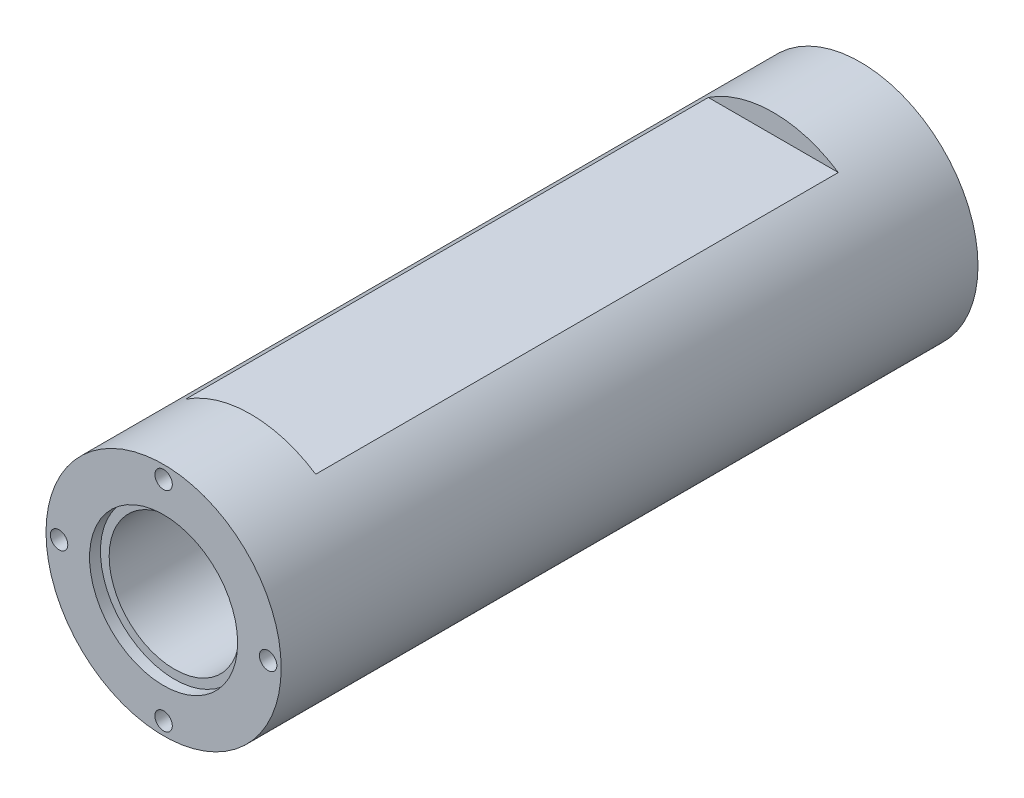
ISO-10303-21;
HEADER;
FILE_DESCRIPTION(('STEP AP214'),'2;1');
FILE_NAME('part.step','',(''),(''),'','','');
FILE_SCHEMA(('AUTOMOTIVE_DESIGN { 1 0 10303 214 1 1 1 1 }'));
ENDSEC;
DATA;
#1=APPLICATION_CONTEXT('core data for automotive mechanical design processes');
#2=APPLICATION_PROTOCOL_DEFINITION('international standard','automotive_design',2000,#1);
#3=PRODUCT_CONTEXT('',#1,'mechanical');
#4=PRODUCT('Part','Part','',(#3));
#5=PRODUCT_RELATED_PRODUCT_CATEGORY('part','',(#4));
#6=PRODUCT_DEFINITION_FORMATION('','',#4);
#7=PRODUCT_DEFINITION_CONTEXT('part definition',#1,'design');
#8=PRODUCT_DEFINITION('design','',#6,#7);
#9=PRODUCT_DEFINITION_SHAPE('','',#8);
#10=(LENGTH_UNIT() NAMED_UNIT(*) SI_UNIT(.MILLI.,.METRE.));
#11=(NAMED_UNIT(*) PLANE_ANGLE_UNIT() SI_UNIT($,.RADIAN.));
#12=(NAMED_UNIT(*) SI_UNIT($,.STERADIAN.) SOLID_ANGLE_UNIT());
#13=UNCERTAINTY_MEASURE_WITH_UNIT(LENGTH_MEASURE(1.E-05),#10,'distance_accuracy_value','');
#14=(GEOMETRIC_REPRESENTATION_CONTEXT(3) GLOBAL_UNCERTAINTY_ASSIGNED_CONTEXT((#13)) GLOBAL_UNIT_ASSIGNED_CONTEXT((#10,
#11,#12)) REPRESENTATION_CONTEXT('',''));
#15=CARTESIAN_POINT('',(0.,0.,0.));
#16=DIRECTION('',(0.,0.,1.));
#17=DIRECTION('',(1.,0.,0.));
#18=AXIS2_PLACEMENT_3D('',#15,#16,#17);
#19=CARTESIAN_POINT('',(0.,0.,160.));
#20=DIRECTION('',(0.,0.,-1.));
#21=DIRECTION('',(-1.,0.,0.));
#22=AXIS2_PLACEMENT_3D('',#19,#20,#21);
#23=CYLINDRICAL_SURFACE('',#22,15.);
#24=CARTESIAN_POINT('',(0.,0.,157.5));
#25=DIRECTION('',(0.,0.,1.));
#26=DIRECTION('',(1.,0.,0.));
#27=AXIS2_PLACEMENT_3D('',#24,#25,#26);
#28=CIRCLE('',#27,15.);
#29=CARTESIAN_POINT('',(15.,0.,157.5));
#30=VERTEX_POINT('',#29);
#31=EDGE_CURVE('E156',#30,#30,#28,.T.);
#32=ORIENTED_EDGE('',*,*,#31,.T.);
#33=EDGE_LOOP('',(#32));
#34=FACE_BOUND('',#33,.T.);
#35=CARTESIAN_POINT('',(0.,0.,2.5));
#36=DIRECTION('',(0.,0.,-1.));
#37=DIRECTION('',(-1.,0.,0.));
#38=AXIS2_PLACEMENT_3D('',#35,#36,#37);
#39=CIRCLE('',#38,15.);
#40=CARTESIAN_POINT('',(-15.,0.,2.5));
#41=VERTEX_POINT('',#40);
#42=EDGE_CURVE('E165',#41,#41,#39,.T.);
#43=ORIENTED_EDGE('',*,*,#42,.T.);
#44=EDGE_LOOP('',(#43));
#45=FACE_BOUND('',#44,.T.);
#46=ADVANCED_FACE('F31',(#34,#45),#23,.F.);
#47=CARTESIAN_POINT('',(0.,0.,160.));
#48=DIRECTION('',(0.,0.,1.));
#49=DIRECTION('',(1.,0.,0.));
#50=AXIS2_PLACEMENT_3D('',#47,#48,#49);
#51=PLANE('',#50);
#52=CARTESIAN_POINT('',(0.,0.,160.));
#53=DIRECTION('',(0.,0.,1.));
#54=DIRECTION('',(1.,0.,0.));
#55=AXIS2_PLACEMENT_3D('',#52,#53,#54);
#56=CIRCLE('',#55,17.);
#57=CARTESIAN_POINT('',(17.,0.,160.));
#58=VERTEX_POINT('',#57);
#59=EDGE_CURVE('E153',#58,#58,#56,.T.);
#60=ORIENTED_EDGE('',*,*,#59,.F.);
#61=EDGE_LOOP('',(#60));
#62=FACE_BOUND('',#61,.T.);
#63=CARTESIAN_POINT('',(-23.9999999999997,-3.35182354132111E-13,160.));
#64=DIRECTION('',(0.,0.,1.));
#65=DIRECTION('',(1.,0.,0.));
#66=AXIS2_PLACEMENT_3D('',#63,#64,#65);
#67=CIRCLE('',#66,2.00000000000066);
#68=CARTESIAN_POINT('',(-21.999999999999,-3.35182354132111E-13,160.));
#69=VERTEX_POINT('',#68);
#70=EDGE_CURVE('E123',#69,#69,#67,.T.);
#71=ORIENTED_EDGE('',*,*,#70,.F.);
#72=EDGE_LOOP('',(#71));
#73=FACE_BOUND('',#72,.T.);
#74=CARTESIAN_POINT('',(6.76243012900129E-13,-24.,160.));
#75=DIRECTION('',(0.,0.,1.));
#76=DIRECTION('',(1.,0.,0.));
#77=AXIS2_PLACEMENT_3D('',#74,#75,#76);
#78=CIRCLE('',#77,2.00000000000081);
#79=CARTESIAN_POINT('',(2.00000000000148,-24.,160.));
#80=VERTEX_POINT('',#79);
#81=EDGE_CURVE('E117',#80,#80,#78,.T.);
#82=ORIENTED_EDGE('',*,*,#81,.F.);
#83=EDGE_LOOP('',(#82));
#84=FACE_BOUND('',#83,.T.);
#85=CARTESIAN_POINT('',(24.,0.,160.));
#86=DIRECTION('',(0.,0.,1.));
#87=DIRECTION('',(1.,0.,0.));
#88=AXIS2_PLACEMENT_3D('',#85,#86,#87);
#89=CIRCLE('',#88,2.);
#90=CARTESIAN_POINT('',(26.,0.,160.));
#91=VERTEX_POINT('',#90);
#92=EDGE_CURVE('E111',#91,#91,#89,.T.);
#93=ORIENTED_EDGE('',*,*,#92,.F.);
#94=EDGE_LOOP('',(#93));
#95=FACE_BOUND('',#94,.T.);
#96=CARTESIAN_POINT('',(0.,24.,160.));
#97=DIRECTION('',(0.,0.,1.));
#98=DIRECTION('',(1.,0.,0.));
#99=AXIS2_PLACEMENT_3D('',#96,#97,#98);
#100=CIRCLE('',#99,2.);
#101=CARTESIAN_POINT('',(2.,24.,160.));
#102=VERTEX_POINT('',#101);
#103=EDGE_CURVE('E105',#102,#102,#100,.T.);
#104=ORIENTED_EDGE('',*,*,#103,.F.);
#105=EDGE_LOOP('',(#104));
#106=FACE_BOUND('',#105,.T.);
#107=CARTESIAN_POINT('',(0.,0.,160.));
#108=DIRECTION('',(0.,0.,1.));
#109=DIRECTION('',(1.,0.,0.));
#110=AXIS2_PLACEMENT_3D('',#107,#108,#109);
#111=CIRCLE('',#110,27.);
#112=CARTESIAN_POINT('',(27.,0.,160.));
#113=VERTEX_POINT('',#112);
#114=EDGE_CURVE('E98',#113,#113,#111,.T.);
#115=ORIENTED_EDGE('',*,*,#114,.T.);
#116=EDGE_LOOP('',(#115));
#117=FACE_BOUND('',#116,.T.);
#118=ADVANCED_FACE('F188',(#62,#73,#84,#95,#106,#117),#51,.T.);
#119=CARTESIAN_POINT('',(0.,0.,0.));
#120=DIRECTION('',(0.,0.,1.));
#121=DIRECTION('',(1.,0.,0.));
#122=AXIS2_PLACEMENT_3D('',#119,#120,#121);
#123=PLANE('',#122);
#124=CARTESIAN_POINT('',(0.,0.,0.));
#125=DIRECTION('',(0.,0.,-1.));
#126=DIRECTION('',(-1.,0.,0.));
#127=AXIS2_PLACEMENT_3D('',#124,#125,#126);
#128=CIRCLE('',#127,17.);
#129=CARTESIAN_POINT('',(-17.,0.,0.));
#130=VERTEX_POINT('',#129);
#131=EDGE_CURVE('E162',#130,#130,#128,.T.);
#132=ORIENTED_EDGE('',*,*,#131,.F.);
#133=EDGE_LOOP('',(#132));
#134=FACE_BOUND('',#133,.T.);
#135=CARTESIAN_POINT('',(23.9999999999997,-3.35182354132111E-13,0.));
#136=DIRECTION('',(0.,0.,-1.));
#137=DIRECTION('',(-1.,0.,0.));
#138=AXIS2_PLACEMENT_3D('',#135,#136,#137);
#139=CIRCLE('',#138,2.00000000000066);
#140=CARTESIAN_POINT('',(21.999999999999,-3.35182354132111E-13,0.));
#141=VERTEX_POINT('',#140);
#142=EDGE_CURVE('E147',#141,#141,#139,.T.);
#143=ORIENTED_EDGE('',*,*,#142,.F.);
#144=EDGE_LOOP('',(#143));
#145=FACE_BOUND('',#144,.T.);
#146=CARTESIAN_POINT('',(-6.76243012900129E-13,-24.,0.));
#147=DIRECTION('',(0.,0.,-1.));
#148=DIRECTION('',(-1.,0.,0.));
#149=AXIS2_PLACEMENT_3D('',#146,#147,#148);
#150=CIRCLE('',#149,2.00000000000081);
#151=CARTESIAN_POINT('',(-2.00000000000148,-24.,0.));
#152=VERTEX_POINT('',#151);
#153=EDGE_CURVE('E141',#152,#152,#150,.T.);
#154=ORIENTED_EDGE('',*,*,#153,.F.);
#155=EDGE_LOOP('',(#154));
#156=FACE_BOUND('',#155,.T.);
#157=CARTESIAN_POINT('',(-24.,0.,0.));
#158=DIRECTION('',(0.,0.,-1.));
#159=DIRECTION('',(-1.,0.,0.));
#160=AXIS2_PLACEMENT_3D('',#157,#158,#159);
#161=CIRCLE('',#160,2.);
#162=CARTESIAN_POINT('',(-26.,0.,0.));
#163=VERTEX_POINT('',#162);
#164=EDGE_CURVE('E135',#163,#163,#161,.T.);
#165=ORIENTED_EDGE('',*,*,#164,.F.);
#166=EDGE_LOOP('',(#165));
#167=FACE_BOUND('',#166,.T.);
#168=CARTESIAN_POINT('',(0.,24.,0.));
#169=DIRECTION('',(0.,0.,-1.));
#170=DIRECTION('',(-1.,0.,0.));
#171=AXIS2_PLACEMENT_3D('',#168,#169,#170);
#172=CIRCLE('',#171,2.);
#173=CARTESIAN_POINT('',(-2.,24.,0.));
#174=VERTEX_POINT('',#173);
#175=EDGE_CURVE('E129',#174,#174,#172,.T.);
#176=ORIENTED_EDGE('',*,*,#175,.F.);
#177=EDGE_LOOP('',(#176));
#178=FACE_BOUND('',#177,.T.);
#179=CARTESIAN_POINT('',(0.,0.,0.));
#180=DIRECTION('',(0.,0.,1.));
#181=DIRECTION('',(1.,0.,0.));
#182=AXIS2_PLACEMENT_3D('',#179,#180,#181);
#183=CIRCLE('',#182,27.);
#184=CARTESIAN_POINT('',(27.,0.,0.));
#185=VERTEX_POINT('',#184);
#186=EDGE_CURVE('E99',#185,#185,#183,.T.);
#187=ORIENTED_EDGE('',*,*,#186,.F.);
#188=EDGE_LOOP('',(#187));
#189=FACE_BOUND('',#188,.T.);
#190=ADVANCED_FACE('F194',(#134,#145,#156,#167,#178,#189),#123,.F.);
#191=CARTESIAN_POINT('',(0.,0.,160.));
#192=DIRECTION('',(0.,0.,-1.));
#193=DIRECTION('',(-1.,0.,0.));
#194=AXIS2_PLACEMENT_3D('',#191,#192,#193);
#195=CYLINDRICAL_SURFACE('',#194,27.);
#196=DIRECTION('',(0.,0.,-1.));
#197=VECTOR('',#196,1.);
#198=CARTESIAN_POINT('',(16.9705627484771,-21.,160.));
#199=LINE('',#198,#197);
#200=CARTESIAN_POINT('',(16.9705627484771,-21.,140.));
#201=VERTEX_POINT('',#200);
#202=CARTESIAN_POINT('',(16.9705627484771,-21.,20.));
#203=VERTEX_POINT('',#202);
#204=EDGE_CURVE('E11',#201,#203,#199,.T.);
#205=ORIENTED_EDGE('',*,*,#204,.T.);
#206=CARTESIAN_POINT('',(0.,0.,20.));
#207=DIRECTION('',(0.,0.,-1.));
#208=DIRECTION('',(0.,1.,0.));
#209=AXIS2_PLACEMENT_3D('',#206,#207,#208);
#210=CIRCLE('',#209,27.);
#211=CARTESIAN_POINT('',(-16.9705627484771,-21.,20.));
#212=VERTEX_POINT('',#211);
#213=EDGE_CURVE('E70',#203,#212,#210,.T.);
#214=ORIENTED_EDGE('',*,*,#213,.T.);
#215=DIRECTION('',(0.,0.,-1.));
#216=VECTOR('',#215,1.);
#217=CARTESIAN_POINT('',(-16.9705627484771,-21.,160.));
#218=LINE('',#217,#216);
#219=CARTESIAN_POINT('',(-16.9705627484771,-21.,140.));
#220=VERTEX_POINT('',#219);
#221=EDGE_CURVE('E74',#212,#220,#218,.F.);
#222=ORIENTED_EDGE('',*,*,#221,.T.);
#223=CARTESIAN_POINT('',(0.,0.,140.));
#224=DIRECTION('',(0.,0.,1.));
#225=DIRECTION('',(1.,0.,0.));
#226=AXIS2_PLACEMENT_3D('',#223,#224,#225);
#227=CIRCLE('',#226,27.);
#228=EDGE_CURVE('E39',#220,#201,#227,.T.);
#229=ORIENTED_EDGE('',*,*,#228,.T.);
#230=EDGE_LOOP('',(#205,#214,#222,#229));
#231=FACE_BOUND('',#230,.T.);
#232=DIRECTION('',(0.,0.,-1.));
#233=VECTOR('',#232,1.);
#234=CARTESIAN_POINT('',(14.9248115565993,22.5,160.));
#235=LINE('',#234,#233);
#236=CARTESIAN_POINT('',(14.9248115565993,22.5,20.));
#237=VERTEX_POINT('',#236);
#238=CARTESIAN_POINT('',(14.9248115565993,22.5,140.));
#239=VERTEX_POINT('',#238);
#240=EDGE_CURVE('E75',#237,#239,#235,.F.);
#241=ORIENTED_EDGE('',*,*,#240,.T.);
#242=CARTESIAN_POINT('',(0.,0.,140.));
#243=DIRECTION('',(0.,0.,1.));
#244=DIRECTION('',(1.,0.,0.));
#245=AXIS2_PLACEMENT_3D('',#242,#243,#244);
#246=CIRCLE('',#245,27.);
#247=CARTESIAN_POINT('',(-14.9248115565993,22.5,140.));
#248=VERTEX_POINT('',#247);
#249=EDGE_CURVE('E95',#239,#248,#246,.T.);
#250=ORIENTED_EDGE('',*,*,#249,.T.);
#251=DIRECTION('',(0.,0.,-1.));
#252=VECTOR('',#251,1.);
#253=CARTESIAN_POINT('',(-14.9248115565993,22.5,160.));
#254=LINE('',#253,#252);
#255=CARTESIAN_POINT('',(-14.9248115565993,22.5,20.));
#256=VERTEX_POINT('',#255);
#257=EDGE_CURVE('E92',#248,#256,#254,.T.);
#258=ORIENTED_EDGE('',*,*,#257,.T.);
#259=CARTESIAN_POINT('',(0.,0.,20.));
#260=DIRECTION('',(0.,0.,-1.));
#261=DIRECTION('',(0.,1.,0.));
#262=AXIS2_PLACEMENT_3D('',#259,#260,#261);
#263=CIRCLE('',#262,27.);
#264=EDGE_CURVE('E90',#256,#237,#263,.T.);
#265=ORIENTED_EDGE('',*,*,#264,.T.);
#266=EDGE_LOOP('',(#241,#250,#258,#265));
#267=FACE_BOUND('',#266,.T.);
#268=ORIENTED_EDGE('',*,*,#114,.F.);
#269=EDGE_LOOP('',(#268));
#270=FACE_BOUND('',#269,.T.);
#271=ORIENTED_EDGE('',*,*,#186,.T.);
#272=EDGE_LOOP('',(#271));
#273=FACE_BOUND('',#272,.T.);
#274=ADVANCED_FACE('F33',(#231,#267,#270,#273),#195,.T.);
#275=CARTESIAN_POINT('',(0.,24.,145.));
#276=DIRECTION('',(0.,0.,1.));
#277=DIRECTION('',(1.,0.,0.));
#278=AXIS2_PLACEMENT_3D('',#275,#276,#277);
#279=CYLINDRICAL_SURFACE('',#278,2.);
#280=CARTESIAN_POINT('',(0.,24.,145.));
#281=DIRECTION('',(0.,0.,1.));
#282=DIRECTION('',(1.,0.,0.));
#283=AXIS2_PLACEMENT_3D('',#280,#281,#282);
#284=CIRCLE('',#283,2.);
#285=CARTESIAN_POINT('',(2.,24.,145.));
#286=VERTEX_POINT('',#285);
#287=EDGE_CURVE('E102',#286,#286,#284,.T.);
#288=ORIENTED_EDGE('',*,*,#287,.F.);
#289=EDGE_LOOP('',(#288));
#290=FACE_BOUND('',#289,.T.);
#291=ORIENTED_EDGE('',*,*,#103,.T.);
#292=EDGE_LOOP('',(#291));
#293=FACE_BOUND('',#292,.T.);
#294=ADVANCED_FACE('F199',(#290,#293),#279,.F.);
#295=CARTESIAN_POINT('',(0.,24.,145.));
#296=DIRECTION('',(0.,0.,1.));
#297=DIRECTION('',(1.,0.,0.));
#298=AXIS2_PLACEMENT_3D('',#295,#296,#297);
#299=PLANE('',#298);
#300=ORIENTED_EDGE('',*,*,#287,.T.);
#301=EDGE_LOOP('',(#300));
#302=FACE_BOUND('',#301,.T.);
#303=ADVANCED_FACE('F255',(#302),#299,.T.);
#304=CARTESIAN_POINT('',(24.,0.,145.));
#305=DIRECTION('',(0.,0.,1.));
#306=DIRECTION('',(1.,0.,0.));
#307=AXIS2_PLACEMENT_3D('',#304,#305,#306);
#308=CYLINDRICAL_SURFACE('',#307,2.);
#309=CARTESIAN_POINT('',(24.,0.,145.));
#310=DIRECTION('',(0.,0.,1.));
#311=DIRECTION('',(1.,0.,0.));
#312=AXIS2_PLACEMENT_3D('',#309,#310,#311);
#313=CIRCLE('',#312,2.);
#314=CARTESIAN_POINT('',(26.,0.,145.));
#315=VERTEX_POINT('',#314);
#316=EDGE_CURVE('E108',#315,#315,#313,.T.);
#317=ORIENTED_EDGE('',*,*,#316,.F.);
#318=EDGE_LOOP('',(#317));
#319=FACE_BOUND('',#318,.T.);
#320=ORIENTED_EDGE('',*,*,#92,.T.);
#321=EDGE_LOOP('',(#320));
#322=FACE_BOUND('',#321,.T.);
#323=ADVANCED_FACE('F252',(#319,#322),#308,.F.);
#324=CARTESIAN_POINT('',(24.,0.,145.));
#325=DIRECTION('',(0.,0.,1.));
#326=DIRECTION('',(1.,0.,0.));
#327=AXIS2_PLACEMENT_3D('',#324,#325,#326);
#328=PLANE('',#327);
#329=ORIENTED_EDGE('',*,*,#316,.T.);
#330=EDGE_LOOP('',(#329));
#331=FACE_BOUND('',#330,.T.);
#332=ADVANCED_FACE('F248',(#331),#328,.T.);
#333=CARTESIAN_POINT('',(6.76243012900129E-13,-24.,145.));
#334=DIRECTION('',(0.,0.,1.));
#335=DIRECTION('',(1.,0.,0.));
#336=AXIS2_PLACEMENT_3D('',#333,#334,#335);
#337=CYLINDRICAL_SURFACE('',#336,2.00000000000081);
#338=CARTESIAN_POINT('',(6.76243012900129E-13,-24.,145.));
#339=DIRECTION('',(0.,0.,1.));
#340=DIRECTION('',(1.,0.,0.));
#341=AXIS2_PLACEMENT_3D('',#338,#339,#340);
#342=CIRCLE('',#341,2.00000000000081);
#343=CARTESIAN_POINT('',(2.00000000000148,-24.,145.));
#344=VERTEX_POINT('',#343);
#345=EDGE_CURVE('E114',#344,#344,#342,.T.);
#346=ORIENTED_EDGE('',*,*,#345,.F.);
#347=EDGE_LOOP('',(#346));
#348=FACE_BOUND('',#347,.T.);
#349=ORIENTED_EDGE('',*,*,#81,.T.);
#350=EDGE_LOOP('',(#349));
#351=FACE_BOUND('',#350,.T.);
#352=ADVANCED_FACE('F244',(#348,#351),#337,.F.);
#353=CARTESIAN_POINT('',(6.76243012900129E-13,-24.,145.));
#354=DIRECTION('',(0.,0.,1.));
#355=DIRECTION('',(1.,0.,0.));
#356=AXIS2_PLACEMENT_3D('',#353,#354,#355);
#357=PLANE('',#356);
#358=ORIENTED_EDGE('',*,*,#345,.T.);
#359=EDGE_LOOP('',(#358));
#360=FACE_BOUND('',#359,.T.);
#361=ADVANCED_FACE('F240',(#360),#357,.T.);
#362=CARTESIAN_POINT('',(-23.9999999999997,-3.35182354132111E-13,145.));
#363=DIRECTION('',(0.,0.,1.));
#364=DIRECTION('',(1.,0.,0.));
#365=AXIS2_PLACEMENT_3D('',#362,#363,#364);
#366=CYLINDRICAL_SURFACE('',#365,2.00000000000066);
#367=CARTESIAN_POINT('',(-23.9999999999997,-3.35182354132111E-13,145.));
#368=DIRECTION('',(0.,0.,1.));
#369=DIRECTION('',(1.,0.,0.));
#370=AXIS2_PLACEMENT_3D('',#367,#368,#369);
#371=CIRCLE('',#370,2.00000000000066);
#372=CARTESIAN_POINT('',(-21.999999999999,-3.35182354132111E-13,145.));
#373=VERTEX_POINT('',#372);
#374=EDGE_CURVE('E120',#373,#373,#371,.T.);
#375=ORIENTED_EDGE('',*,*,#374,.F.);
#376=EDGE_LOOP('',(#375));
#377=FACE_BOUND('',#376,.T.);
#378=ORIENTED_EDGE('',*,*,#70,.T.);
#379=EDGE_LOOP('',(#378));
#380=FACE_BOUND('',#379,.T.);
#381=ADVANCED_FACE('F232',(#377,#380),#366,.F.);
#382=CARTESIAN_POINT('',(-23.9999999999997,-3.35182354132111E-13,145.));
#383=DIRECTION('',(0.,0.,1.));
#384=DIRECTION('',(1.,0.,0.));
#385=AXIS2_PLACEMENT_3D('',#382,#383,#384);
#386=PLANE('',#385);
#387=ORIENTED_EDGE('',*,*,#374,.T.);
#388=EDGE_LOOP('',(#387));
#389=FACE_BOUND('',#388,.T.);
#390=ADVANCED_FACE('F222',(#389),#386,.T.);
#391=CARTESIAN_POINT('',(0.,24.,15.));
#392=DIRECTION('',(0.,0.,-1.));
#393=DIRECTION('',(-1.,0.,0.));
#394=AXIS2_PLACEMENT_3D('',#391,#392,#393);
#395=CYLINDRICAL_SURFACE('',#394,2.);
#396=CARTESIAN_POINT('',(0.,24.,15.));
#397=DIRECTION('',(0.,0.,-1.));
#398=DIRECTION('',(-1.,0.,0.));
#399=AXIS2_PLACEMENT_3D('',#396,#397,#398);
#400=CIRCLE('',#399,2.);
#401=CARTESIAN_POINT('',(-2.,24.,15.));
#402=VERTEX_POINT('',#401);
#403=EDGE_CURVE('E126',#402,#402,#400,.T.);
#404=ORIENTED_EDGE('',*,*,#403,.F.);
#405=EDGE_LOOP('',(#404));
#406=FACE_BOUND('',#405,.T.);
#407=ORIENTED_EDGE('',*,*,#175,.T.);
#408=EDGE_LOOP('',(#407));
#409=FACE_BOUND('',#408,.T.);
#410=ADVANCED_FACE('F219',(#406,#409),#395,.F.);
#411=CARTESIAN_POINT('',(0.,24.,15.));
#412=DIRECTION('',(0.,0.,-1.));
#413=DIRECTION('',(-1.,0.,0.));
#414=AXIS2_PLACEMENT_3D('',#411,#412,#413);
#415=PLANE('',#414);
#416=ORIENTED_EDGE('',*,*,#403,.T.);
#417=EDGE_LOOP('',(#416));
#418=FACE_BOUND('',#417,.T.);
#419=ADVANCED_FACE('F221',(#418),#415,.T.);
#420=CARTESIAN_POINT('',(-24.,0.,15.));
#421=DIRECTION('',(0.,0.,-1.));
#422=DIRECTION('',(-1.,0.,0.));
#423=AXIS2_PLACEMENT_3D('',#420,#421,#422);
#424=CYLINDRICAL_SURFACE('',#423,2.);
#425=CARTESIAN_POINT('',(-24.,0.,15.));
#426=DIRECTION('',(0.,0.,-1.));
#427=DIRECTION('',(-1.,0.,0.));
#428=AXIS2_PLACEMENT_3D('',#425,#426,#427);
#429=CIRCLE('',#428,2.);
#430=CARTESIAN_POINT('',(-26.,0.,15.));
#431=VERTEX_POINT('',#430);
#432=EDGE_CURVE('E132',#431,#431,#429,.T.);
#433=ORIENTED_EDGE('',*,*,#432,.F.);
#434=EDGE_LOOP('',(#433));
#435=FACE_BOUND('',#434,.T.);
#436=ORIENTED_EDGE('',*,*,#164,.T.);
#437=EDGE_LOOP('',(#436));
#438=FACE_BOUND('',#437,.T.);
#439=ADVANCED_FACE('F229',(#435,#438),#424,.F.);
#440=CARTESIAN_POINT('',(-24.,0.,15.));
#441=DIRECTION('',(0.,0.,-1.));
#442=DIRECTION('',(-1.,0.,0.));
#443=AXIS2_PLACEMENT_3D('',#440,#441,#442);
#444=PLANE('',#443);
#445=ORIENTED_EDGE('',*,*,#432,.T.);
#446=EDGE_LOOP('',(#445));
#447=FACE_BOUND('',#446,.T.);
#448=ADVANCED_FACE('F358',(#447),#444,.T.);
#449=CARTESIAN_POINT('',(-6.76243012900129E-13,-24.,15.));
#450=DIRECTION('',(0.,0.,-1.));
#451=DIRECTION('',(-1.,0.,0.));
#452=AXIS2_PLACEMENT_3D('',#449,#450,#451);
#453=CYLINDRICAL_SURFACE('',#452,2.00000000000081);
#454=CARTESIAN_POINT('',(-6.76243012900129E-13,-24.,15.));
#455=DIRECTION('',(0.,0.,-1.));
#456=DIRECTION('',(-1.,0.,0.));
#457=AXIS2_PLACEMENT_3D('',#454,#455,#456);
#458=CIRCLE('',#457,2.00000000000081);
#459=CARTESIAN_POINT('',(-2.00000000000148,-24.,15.));
#460=VERTEX_POINT('',#459);
#461=EDGE_CURVE('E138',#460,#460,#458,.T.);
#462=ORIENTED_EDGE('',*,*,#461,.F.);
#463=EDGE_LOOP('',(#462));
#464=FACE_BOUND('',#463,.T.);
#465=ORIENTED_EDGE('',*,*,#153,.T.);
#466=EDGE_LOOP('',(#465));
#467=FACE_BOUND('',#466,.T.);
#468=ADVANCED_FACE('F354',(#464,#467),#453,.F.);
#469=CARTESIAN_POINT('',(-6.76243012900129E-13,-24.,15.));
#470=DIRECTION('',(0.,0.,-1.));
#471=DIRECTION('',(-1.,0.,0.));
#472=AXIS2_PLACEMENT_3D('',#469,#470,#471);
#473=PLANE('',#472);
#474=ORIENTED_EDGE('',*,*,#461,.T.);
#475=EDGE_LOOP('',(#474));
#476=FACE_BOUND('',#475,.T.);
#477=ADVANCED_FACE('F350',(#476),#473,.T.);
#478=CARTESIAN_POINT('',(23.9999999999997,-3.35182354132111E-13,15.));
#479=DIRECTION('',(0.,0.,-1.));
#480=DIRECTION('',(-1.,0.,0.));
#481=AXIS2_PLACEMENT_3D('',#478,#479,#480);
#482=CYLINDRICAL_SURFACE('',#481,2.00000000000066);
#483=CARTESIAN_POINT('',(23.9999999999997,-3.35182354132111E-13,15.));
#484=DIRECTION('',(0.,0.,-1.));
#485=DIRECTION('',(-1.,0.,0.));
#486=AXIS2_PLACEMENT_3D('',#483,#484,#485);
#487=CIRCLE('',#486,2.00000000000066);
#488=CARTESIAN_POINT('',(21.999999999999,-3.35182354132111E-13,15.));
#489=VERTEX_POINT('',#488);
#490=EDGE_CURVE('E144',#489,#489,#487,.T.);
#491=ORIENTED_EDGE('',*,*,#490,.F.);
#492=EDGE_LOOP('',(#491));
#493=FACE_BOUND('',#492,.T.);
#494=ORIENTED_EDGE('',*,*,#142,.T.);
#495=EDGE_LOOP('',(#494));
#496=FACE_BOUND('',#495,.T.);
#497=ADVANCED_FACE('F346',(#493,#496),#482,.F.);
#498=CARTESIAN_POINT('',(23.9999999999997,-3.35182354132111E-13,15.));
#499=DIRECTION('',(0.,0.,-1.));
#500=DIRECTION('',(-1.,0.,0.));
#501=AXIS2_PLACEMENT_3D('',#498,#499,#500);
#502=PLANE('',#501);
#503=ORIENTED_EDGE('',*,*,#490,.T.);
#504=EDGE_LOOP('',(#503));
#505=FACE_BOUND('',#504,.T.);
#506=ADVANCED_FACE('F342',(#505),#502,.T.);
#507=CARTESIAN_POINT('',(0.,0.,157.5));
#508=DIRECTION('',(0.,0.,1.));
#509=DIRECTION('',(1.,0.,0.));
#510=AXIS2_PLACEMENT_3D('',#507,#508,#509);
#511=CYLINDRICAL_SURFACE('',#510,17.);
#512=CARTESIAN_POINT('',(0.,0.,157.5));
#513=DIRECTION('',(0.,0.,1.));
#514=DIRECTION('',(1.,0.,0.));
#515=AXIS2_PLACEMENT_3D('',#512,#513,#514);
#516=CIRCLE('',#515,17.);
#517=CARTESIAN_POINT('',(17.,0.,157.5));
#518=VERTEX_POINT('',#517);
#519=EDGE_CURVE('E150',#518,#518,#516,.T.);
#520=ORIENTED_EDGE('',*,*,#519,.F.);
#521=EDGE_LOOP('',(#520));
#522=FACE_BOUND('',#521,.T.);
#523=ORIENTED_EDGE('',*,*,#59,.T.);
#524=EDGE_LOOP('',(#523));
#525=FACE_BOUND('',#524,.T.);
#526=ADVANCED_FACE('F338',(#522,#525),#511,.F.);
#527=CARTESIAN_POINT('',(0.,0.,157.5));
#528=DIRECTION('',(0.,0.,1.));
#529=DIRECTION('',(1.,0.,0.));
#530=AXIS2_PLACEMENT_3D('',#527,#528,#529);
#531=PLANE('',#530);
#532=ORIENTED_EDGE('',*,*,#31,.F.);
#533=EDGE_LOOP('',(#532));
#534=FACE_BOUND('',#533,.T.);
#535=ORIENTED_EDGE('',*,*,#519,.T.);
#536=EDGE_LOOP('',(#535));
#537=FACE_BOUND('',#536,.T.);
#538=ADVANCED_FACE('F334',(#534,#537),#531,.T.);
#539=CARTESIAN_POINT('',(0.,0.,2.5));
#540=DIRECTION('',(0.,0.,-1.));
#541=DIRECTION('',(-1.,0.,0.));
#542=AXIS2_PLACEMENT_3D('',#539,#540,#541);
#543=CYLINDRICAL_SURFACE('',#542,17.);
#544=CARTESIAN_POINT('',(0.,0.,2.5));
#545=DIRECTION('',(0.,0.,-1.));
#546=DIRECTION('',(-1.,0.,0.));
#547=AXIS2_PLACEMENT_3D('',#544,#545,#546);
#548=CIRCLE('',#547,17.);
#549=CARTESIAN_POINT('',(-17.,0.,2.5));
#550=VERTEX_POINT('',#549);
#551=EDGE_CURVE('E161',#550,#550,#548,.T.);
#552=ORIENTED_EDGE('',*,*,#551,.F.);
#553=EDGE_LOOP('',(#552));
#554=FACE_BOUND('',#553,.T.);
#555=ORIENTED_EDGE('',*,*,#131,.T.);
#556=EDGE_LOOP('',(#555));
#557=FACE_BOUND('',#556,.T.);
#558=ADVANCED_FACE('F330',(#554,#557),#543,.F.);
#559=CARTESIAN_POINT('',(0.,0.,2.5));
#560=DIRECTION('',(0.,0.,-1.));
#561=DIRECTION('',(-1.,0.,0.));
#562=AXIS2_PLACEMENT_3D('',#559,#560,#561);
#563=PLANE('',#562);
#564=ORIENTED_EDGE('',*,*,#42,.F.);
#565=EDGE_LOOP('',(#564));
#566=FACE_BOUND('',#565,.T.);
#567=ORIENTED_EDGE('',*,*,#551,.T.);
#568=EDGE_LOOP('',(#567));
#569=FACE_BOUND('',#568,.T.);
#570=ADVANCED_FACE('F283',(#566,#569),#563,.T.);
#571=CARTESIAN_POINT('',(-27.,22.5,20.));
#572=DIRECTION('',(0.,0.,-1.));
#573=DIRECTION('',(0.,1.,0.));
#574=AXIS2_PLACEMENT_3D('',#571,#572,#573);
#575=PLANE('',#574);
#576=ORIENTED_EDGE('',*,*,#264,.F.);
#577=DIRECTION('',(1.,0.,0.));
#578=VECTOR('',#577,1.);
#579=CARTESIAN_POINT('',(-27.,22.5,20.));
#580=LINE('',#579,#578);
#581=EDGE_CURVE('E170',#256,#237,#580,.T.);
#582=ORIENTED_EDGE('',*,*,#581,.T.);
#583=EDGE_LOOP('',(#576,#582));
#584=FACE_BOUND('',#583,.T.);
#585=ADVANCED_FACE('F288',(#584),#575,.F.);
#586=CARTESIAN_POINT('',(-27.,22.5,140.));
#587=DIRECTION('',(0.,-1.,0.));
#588=DIRECTION('',(0.,0.,-1.));
#589=AXIS2_PLACEMENT_3D('',#586,#587,#588);
#590=PLANE('',#589);
#591=DIRECTION('',(1.,0.,0.));
#592=VECTOR('',#591,1.);
#593=CARTESIAN_POINT('',(-27.,22.5,140.));
#594=LINE('',#593,#592);
#595=EDGE_CURVE('E52',#248,#239,#594,.T.);
#596=ORIENTED_EDGE('',*,*,#595,.T.);
#597=ORIENTED_EDGE('',*,*,#240,.F.);
#598=ORIENTED_EDGE('',*,*,#581,.F.);
#599=ORIENTED_EDGE('',*,*,#257,.F.);
#600=EDGE_LOOP('',(#596,#597,#598,#599));
#601=FACE_BOUND('',#600,.T.);
#602=ADVANCED_FACE('F183',(#601),#590,.F.);
#603=CARTESIAN_POINT('',(-27.,22.5,140.));
#604=DIRECTION('',(0.,0.,1.));
#605=DIRECTION('',(1.,0.,0.));
#606=AXIS2_PLACEMENT_3D('',#603,#604,#605);
#607=PLANE('',#606);
#608=ORIENTED_EDGE('',*,*,#595,.F.);
#609=ORIENTED_EDGE('',*,*,#249,.F.);
#610=EDGE_LOOP('',(#608,#609));
#611=FACE_BOUND('',#610,.T.);
#612=ADVANCED_FACE('F176',(#611),#607,.F.);
#613=CARTESIAN_POINT('',(-27.,-21.,140.));
#614=DIRECTION('',(0.,0.,1.));
#615=DIRECTION('',(1.,0.,0.));
#616=AXIS2_PLACEMENT_3D('',#613,#614,#615);
#617=PLANE('',#616);
#618=DIRECTION('',(1.,0.,0.));
#619=VECTOR('',#618,1.);
#620=CARTESIAN_POINT('',(-27.,-21.,140.));
#621=LINE('',#620,#619);
#622=EDGE_CURVE('E81',#220,#201,#621,.T.);
#623=ORIENTED_EDGE('',*,*,#622,.T.);
#624=ORIENTED_EDGE('',*,*,#228,.F.);
#625=EDGE_LOOP('',(#623,#624));
#626=FACE_BOUND('',#625,.T.);
#627=ADVANCED_FACE('F174',(#626),#617,.F.);
#628=CARTESIAN_POINT('',(-27.,-21.,140.));
#629=DIRECTION('',(0.,1.,0.));
#630=DIRECTION('',(0.,0.,1.));
#631=AXIS2_PLACEMENT_3D('',#628,#629,#630);
#632=PLANE('',#631);
#633=ORIENTED_EDGE('',*,*,#622,.F.);
#634=ORIENTED_EDGE('',*,*,#221,.F.);
#635=DIRECTION('',(1.,0.,0.));
#636=VECTOR('',#635,1.);
#637=CARTESIAN_POINT('',(-27.,-21.,20.));
#638=LINE('',#637,#636);
#639=EDGE_CURVE('E45',#212,#203,#638,.T.);
#640=ORIENTED_EDGE('',*,*,#639,.T.);
#641=ORIENTED_EDGE('',*,*,#204,.F.);
#642=EDGE_LOOP('',(#633,#634,#640,#641));
#643=FACE_BOUND('',#642,.T.);
#644=ADVANCED_FACE('F79',(#643),#632,.F.);
#645=CARTESIAN_POINT('',(-27.,-21.,20.));
#646=DIRECTION('',(0.,0.,-1.));
#647=DIRECTION('',(0.,1.,0.));
#648=AXIS2_PLACEMENT_3D('',#645,#646,#647);
#649=PLANE('',#648);
#650=ORIENTED_EDGE('',*,*,#639,.F.);
#651=ORIENTED_EDGE('',*,*,#213,.F.);
#652=EDGE_LOOP('',(#650,#651));
#653=FACE_BOUND('',#652,.T.);
#654=ADVANCED_FACE('F71',(#653),#649,.F.);
#655=CLOSED_SHELL('',(#46,#118,#190,#274,#294,#303,#323,#332,#352,#361,#381,#390,#410,#419,#439,
#448,#468,#477,#497,#506,#526,#538,#558,#570,#585,#602,#612,#627,#644,#654));
#656=MANIFOLD_SOLID_BREP('B2',#655);
#657=ADVANCED_BREP_SHAPE_REPRESENTATION('',(#18,#656),#14);
#658=SHAPE_DEFINITION_REPRESENTATION(#9,#657);
ENDSEC;
END-ISO-10303-21;
